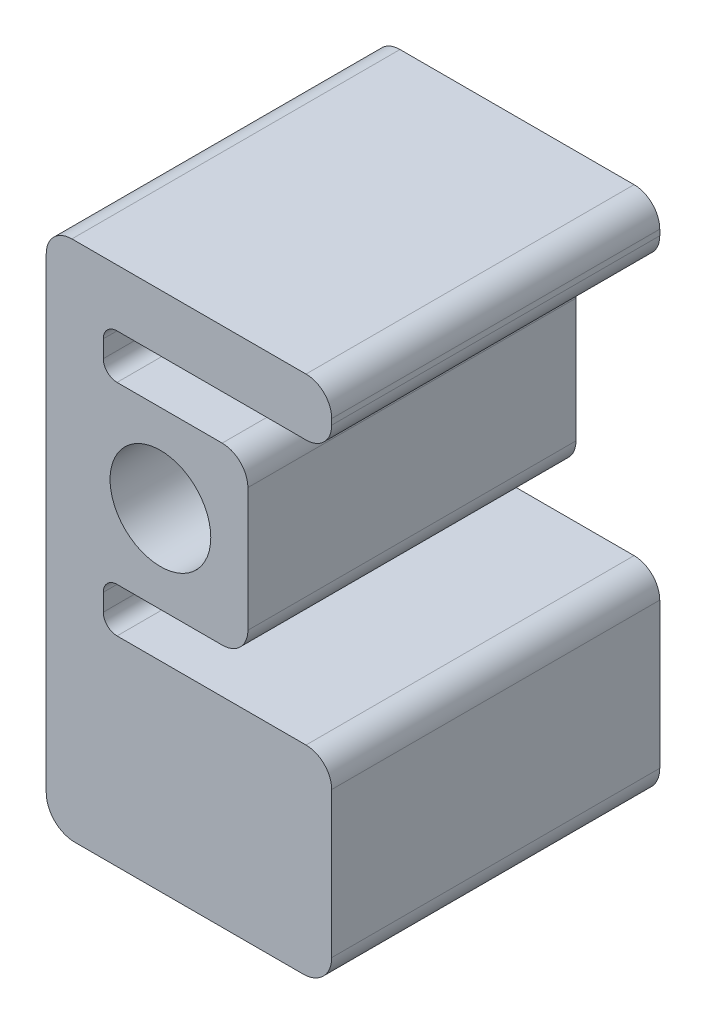
ISO-10303-21;
HEADER;
FILE_DESCRIPTION(('STEP AP214'),'2;1');
FILE_NAME('part.step','',(''),(''),'','','');
FILE_SCHEMA(('AUTOMOTIVE_DESIGN { 1 0 10303 214 1 1 1 1 }'));
ENDSEC;
DATA;
#1=APPLICATION_CONTEXT('core data for automotive mechanical design processes');
#2=APPLICATION_PROTOCOL_DEFINITION('international standard','automotive_design',2000,#1);
#3=PRODUCT_CONTEXT('',#1,'mechanical');
#4=PRODUCT('Part','Part','',(#3));
#5=PRODUCT_RELATED_PRODUCT_CATEGORY('part','',(#4));
#6=PRODUCT_DEFINITION_FORMATION('','',#4);
#7=PRODUCT_DEFINITION_CONTEXT('part definition',#1,'design');
#8=PRODUCT_DEFINITION('design','',#6,#7);
#9=PRODUCT_DEFINITION_SHAPE('','',#8);
#10=(LENGTH_UNIT() NAMED_UNIT(*) SI_UNIT(.MILLI.,.METRE.));
#11=(NAMED_UNIT(*) PLANE_ANGLE_UNIT() SI_UNIT($,.RADIAN.));
#12=(NAMED_UNIT(*) SI_UNIT($,.STERADIAN.) SOLID_ANGLE_UNIT());
#13=UNCERTAINTY_MEASURE_WITH_UNIT(LENGTH_MEASURE(1.E-05),#10,'distance_accuracy_value','');
#14=(GEOMETRIC_REPRESENTATION_CONTEXT(3) GLOBAL_UNCERTAINTY_ASSIGNED_CONTEXT((#13)) GLOBAL_UNIT_ASSIGNED_CONTEXT((#10,
#11,#12)) REPRESENTATION_CONTEXT('',''));
#15=CARTESIAN_POINT('',(0.,0.,0.));
#16=DIRECTION('',(0.,0.,1.));
#17=DIRECTION('',(1.,0.,0.));
#18=AXIS2_PLACEMENT_3D('',#15,#16,#17);
#19=CARTESIAN_POINT('',(-9.65199999999999,-22.503,72.971741788));
#20=DIRECTION('',(0.,0.,-1.));
#21=DIRECTION('',(-1.,0.,0.));
#22=AXIS2_PLACEMENT_3D('',#19,#20,#21);
#23=PLANE('',#22);
#24=DIRECTION('',(1.,0.,0.));
#25=VECTOR('',#24,1.);
#26=CARTESIAN_POINT('',(13.74,-19.455,72.971741788));
#27=LINE('',#26,#25);
#28=CARTESIAN_POINT('',(-9.65199999999999,-19.455,72.971741788));
#29=VERTEX_POINT('',#28);
#30=CARTESIAN_POINT('',(13.74,-19.455,72.971741788));
#31=VERTEX_POINT('',#30);
#32=EDGE_CURVE('E63',#29,#31,#27,.T.);
#33=ORIENTED_EDGE('',*,*,#32,.T.);
#34=CARTESIAN_POINT('',(13.74,-13.74,72.971741788));
#35=DIRECTION('',(0.,0.,1.));
#36=DIRECTION('',(-1.,0.,0.));
#37=AXIS2_PLACEMENT_3D('',#34,#35,#36);
#38=CIRCLE('',#37,5.715);
#39=CARTESIAN_POINT('',(19.455,-13.74,72.971741788));
#40=VERTEX_POINT('',#39);
#41=EDGE_CURVE('E155',#31,#40,#38,.T.);
#42=ORIENTED_EDGE('',*,*,#41,.T.);
#43=DIRECTION('',(0.,1.,0.));
#44=VECTOR('',#43,1.);
#45=CARTESIAN_POINT('',(19.455,0.,72.971741788));
#46=LINE('',#45,#44);
#47=CARTESIAN_POINT('',(19.455,13.74,72.971741788));
#48=VERTEX_POINT('',#47);
#49=EDGE_CURVE('E402',#40,#48,#46,.T.);
#50=ORIENTED_EDGE('',*,*,#49,.T.);
#51=CARTESIAN_POINT('',(13.74,13.74,72.971741788));
#52=DIRECTION('',(0.,0.,1.));
#53=DIRECTION('',(-1.,0.,0.));
#54=AXIS2_PLACEMENT_3D('',#51,#52,#53);
#55=CIRCLE('',#54,5.715);
#56=CARTESIAN_POINT('',(13.74,19.455,72.971741788));
#57=VERTEX_POINT('',#56);
#58=EDGE_CURVE('E422',#48,#57,#55,.T.);
#59=ORIENTED_EDGE('',*,*,#58,.T.);
#60=DIRECTION('',(-1.,0.,0.));
#61=VECTOR('',#60,1.);
#62=CARTESIAN_POINT('',(0.,19.455,72.971741788));
#63=LINE('',#62,#61);
#64=CARTESIAN_POINT('',(-9.65199999999999,19.455,72.971741788));
#65=VERTEX_POINT('',#64);
#66=EDGE_CURVE('E418',#57,#65,#63,.T.);
#67=ORIENTED_EDGE('',*,*,#66,.T.);
#68=CARTESIAN_POINT('',(-9.65199999999999,22.503,72.971741788));
#69=DIRECTION('',(0.,0.,-1.));
#70=DIRECTION('',(-1.,0.,0.));
#71=AXIS2_PLACEMENT_3D('',#68,#69,#70);
#72=CIRCLE('',#71,3.048);
#73=CARTESIAN_POINT('',(-12.7,22.503,72.971741788));
#74=VERTEX_POINT('',#73);
#75=EDGE_CURVE('E421',#65,#74,#72,.T.);
#76=ORIENTED_EDGE('',*,*,#75,.T.);
#77=DIRECTION('',(0.,1.,0.));
#78=VECTOR('',#77,1.);
#79=CARTESIAN_POINT('',(-12.7,22.503,72.971741788));
#80=LINE('',#79,#78);
#81=CARTESIAN_POINT('',(-12.7,26.332,72.971741788));
#82=VERTEX_POINT('',#81);
#83=EDGE_CURVE('E426',#74,#82,#80,.T.);
#84=ORIENTED_EDGE('',*,*,#83,.T.);
#85=CARTESIAN_POINT('',(-9.65199999999999,26.332,72.971741788));
#86=DIRECTION('',(0.,0.,-1.));
#87=DIRECTION('',(-1.,0.,0.));
#88=AXIS2_PLACEMENT_3D('',#85,#86,#87);
#89=CIRCLE('',#88,3.048);
#90=CARTESIAN_POINT('',(-9.65199999999999,29.38,72.971741788));
#91=VERTEX_POINT('',#90);
#92=EDGE_CURVE('E433',#82,#91,#89,.T.);
#93=ORIENTED_EDGE('',*,*,#92,.T.);
#94=DIRECTION('',(1.,0.,0.));
#95=VECTOR('',#94,1.);
#96=CARTESIAN_POINT('',(-9.65199999999999,29.38,72.971741788));
#97=LINE('',#96,#95);
#98=CARTESIAN_POINT('',(32.385,29.38,72.971741788));
#99=VERTEX_POINT('',#98);
#100=EDGE_CURVE('E436',#91,#99,#97,.T.);
#101=ORIENTED_EDGE('',*,*,#100,.T.);
#102=CARTESIAN_POINT('',(32.385,35.095,72.971741788));
#103=DIRECTION('',(0.,0.,1.));
#104=DIRECTION('',(1.,0.,0.));
#105=AXIS2_PLACEMENT_3D('',#102,#103,#104);
#106=CIRCLE('',#105,5.715);
#107=CARTESIAN_POINT('',(38.1,35.095,72.971741788));
#108=VERTEX_POINT('',#107);
#109=EDGE_CURVE('E439',#99,#108,#106,.T.);
#110=ORIENTED_EDGE('',*,*,#109,.T.);
#111=DIRECTION('',(0.,1.,0.));
#112=VECTOR('',#111,1.);
#113=CARTESIAN_POINT('',(38.1,35.095,72.971741788));
#114=LINE('',#113,#112);
#115=CARTESIAN_POINT('',(38.1,36.365,72.971741788));
#116=VERTEX_POINT('',#115);
#117=EDGE_CURVE('E442',#108,#116,#114,.T.);
#118=ORIENTED_EDGE('',*,*,#117,.T.);
#119=CARTESIAN_POINT('',(32.385,36.365,72.971741788));
#120=DIRECTION('',(0.,0.,1.));
#121=DIRECTION('',(1.,0.,0.));
#122=AXIS2_PLACEMENT_3D('',#119,#120,#121);
#123=CIRCLE('',#122,5.715);
#124=CARTESIAN_POINT('',(32.385,42.08,72.971741788));
#125=VERTEX_POINT('',#124);
#126=EDGE_CURVE('E445',#116,#125,#123,.T.);
#127=ORIENTED_EDGE('',*,*,#126,.T.);
#128=DIRECTION('',(-1.,0.,0.));
#129=VECTOR('',#128,1.);
#130=CARTESIAN_POINT('',(32.385,42.08,72.971741788));
#131=LINE('',#130,#129);
#132=CARTESIAN_POINT('',(-19.685,42.08,72.971741788));
#133=VERTEX_POINT('',#132);
#134=EDGE_CURVE('E448',#125,#133,#131,.T.);
#135=ORIENTED_EDGE('',*,*,#134,.T.);
#136=CARTESIAN_POINT('',(-19.685,36.365,72.971741788));
#137=DIRECTION('',(0.,0.,1.));
#138=DIRECTION('',(1.,0.,0.));
#139=AXIS2_PLACEMENT_3D('',#136,#137,#138);
#140=CIRCLE('',#139,5.71499999999999);
#141=CARTESIAN_POINT('',(-25.4,36.365,72.971741788));
#142=VERTEX_POINT('',#141);
#143=EDGE_CURVE('E451',#133,#142,#140,.T.);
#144=ORIENTED_EDGE('',*,*,#143,.T.);
#145=DIRECTION('',(0.,-1.,0.));
#146=VECTOR('',#145,1.);
#147=CARTESIAN_POINT('',(-25.4,-67.4799999619999,72.971741788));
#148=LINE('',#147,#146);
#149=CARTESIAN_POINT('',(-25.4,-67.479999962,72.971741788));
#150=VERTEX_POINT('',#149);
#151=EDGE_CURVE('E454',#142,#150,#148,.T.);
#152=ORIENTED_EDGE('',*,*,#151,.T.);
#153=CARTESIAN_POINT('',(-19.05,-67.479999962,72.971741788));
#154=DIRECTION('',(0.,0.,1.));
#155=DIRECTION('',(-1.,0.,0.));
#156=AXIS2_PLACEMENT_3D('',#153,#154,#155);
#157=CIRCLE('',#156,6.35);
#158=CARTESIAN_POINT('',(-19.0499999999999,-73.829999962,72.971741788));
#159=VERTEX_POINT('',#158);
#160=EDGE_CURVE('E457',#150,#159,#157,.T.);
#161=ORIENTED_EDGE('',*,*,#160,.T.);
#162=DIRECTION('',(1.,0.,0.));
#163=VECTOR('',#162,1.);
#164=CARTESIAN_POINT('',(31.75,-73.829999962,72.971741788));
#165=LINE('',#164,#163);
#166=CARTESIAN_POINT('',(31.75,-73.829999962,72.971741788));
#167=VERTEX_POINT('',#166);
#168=EDGE_CURVE('E460',#159,#167,#165,.T.);
#169=ORIENTED_EDGE('',*,*,#168,.T.);
#170=CARTESIAN_POINT('',(31.75,-67.479999962,72.971741788));
#171=DIRECTION('',(0.,0.,1.));
#172=DIRECTION('',(1.,0.,0.));
#173=AXIS2_PLACEMENT_3D('',#170,#171,#172);
#174=CIRCLE('',#173,6.35);
#175=CARTESIAN_POINT('',(38.1,-67.4799999619999,72.971741788));
#176=VERTEX_POINT('',#175);
#177=EDGE_CURVE('E463',#167,#176,#174,.T.);
#178=ORIENTED_EDGE('',*,*,#177,.T.);
#179=DIRECTION('',(0.,1.,0.));
#180=VECTOR('',#179,1.);
#181=CARTESIAN_POINT('',(38.1,-67.4799999619999,72.971741788));
#182=LINE('',#181,#180);
#183=CARTESIAN_POINT('',(38.1,-35.094999962,72.971741788));
#184=VERTEX_POINT('',#183);
#185=EDGE_CURVE('E466',#176,#184,#182,.T.);
#186=ORIENTED_EDGE('',*,*,#185,.T.);
#187=CARTESIAN_POINT('',(32.385,-35.094999962,72.971741788));
#188=DIRECTION('',(0.,0.,1.));
#189=DIRECTION('',(1.,0.,0.));
#190=AXIS2_PLACEMENT_3D('',#187,#188,#189);
#191=CIRCLE('',#190,5.71499999999999);
#192=CARTESIAN_POINT('',(32.385,-29.379999962,72.971741788));
#193=VERTEX_POINT('',#192);
#194=EDGE_CURVE('E469',#184,#193,#191,.T.);
#195=ORIENTED_EDGE('',*,*,#194,.T.);
#196=DIRECTION('',(-1.,0.,0.));
#197=VECTOR('',#196,1.);
#198=CARTESIAN_POINT('',(32.385,-29.379999962,72.971741788));
#199=LINE('',#198,#197);
#200=CARTESIAN_POINT('',(-9.65199999999999,-29.379999962,72.971741788));
#201=VERTEX_POINT('',#200);
#202=EDGE_CURVE('E223',#193,#201,#199,.T.);
#203=ORIENTED_EDGE('',*,*,#202,.T.);
#204=CARTESIAN_POINT('',(-9.65199999999999,-26.331999962,72.971741788));
#205=DIRECTION('',(0.,0.,-1.));
#206=DIRECTION('',(-1.,0.,0.));
#207=AXIS2_PLACEMENT_3D('',#204,#205,#206);
#208=CIRCLE('',#207,3.048);
#209=CARTESIAN_POINT('',(-12.7,-26.331999962,72.971741788));
#210=VERTEX_POINT('',#209);
#211=EDGE_CURVE('E217',#201,#210,#208,.T.);
#212=ORIENTED_EDGE('',*,*,#211,.T.);
#213=DIRECTION('',(0.,1.,0.));
#214=VECTOR('',#213,1.);
#215=CARTESIAN_POINT('',(-12.7,-26.331999962,72.971741788));
#216=LINE('',#215,#214);
#217=CARTESIAN_POINT('',(-12.7,-22.503,72.971741788));
#218=VERTEX_POINT('',#217);
#219=EDGE_CURVE('E221',#210,#218,#216,.T.);
#220=ORIENTED_EDGE('',*,*,#219,.T.);
#221=CARTESIAN_POINT('',(-9.65199999999999,-22.503,72.971741788));
#222=DIRECTION('',(0.,0.,-1.));
#223=DIRECTION('',(-1.,0.,0.));
#224=AXIS2_PLACEMENT_3D('',#221,#222,#223);
#225=CIRCLE('',#224,3.048);
#226=EDGE_CURVE('E240',#218,#29,#225,.T.);
#227=ORIENTED_EDGE('',*,*,#226,.T.);
#228=EDGE_LOOP('',(#33,#42,#50,#59,#67,#76,#84,#93,#101,#110,#118,#127,#135,#144,#152,#161,#169,
#178,#186,#195,#203,#212,#220,#227));
#229=FACE_BOUND('',#228,.T.);
#230=CARTESIAN_POINT('',(0.,0.,72.971741788));
#231=DIRECTION('',(0.,0.,1.));
#232=DIRECTION('',(1.,0.,0.));
#233=AXIS2_PLACEMENT_3D('',#230,#231,#232);
#234=CIRCLE('',#233,11.2);
#235=CARTESIAN_POINT('',(11.2,0.,72.971741788));
#236=VERTEX_POINT('',#235);
#237=EDGE_CURVE('E252',#236,#236,#234,.T.);
#238=ORIENTED_EDGE('',*,*,#237,.F.);
#239=EDGE_LOOP('',(#238));
#240=FACE_BOUND('',#239,.T.);
#241=ADVANCED_FACE('F45',(#229,#240),#23,.F.);
#242=CARTESIAN_POINT('',(-9.65199999999999,-22.503,0.));
#243=DIRECTION('',(0.,0.,-1.));
#244=DIRECTION('',(-1.,0.,0.));
#245=AXIS2_PLACEMENT_3D('',#242,#243,#244);
#246=PLANE('',#245);
#247=CARTESIAN_POINT('',(13.74,-13.74,0.));
#248=DIRECTION('',(0.,0.,1.));
#249=DIRECTION('',(-1.,0.,0.));
#250=AXIS2_PLACEMENT_3D('',#247,#248,#249);
#251=CIRCLE('',#250,5.715);
#252=CARTESIAN_POINT('',(13.74,-19.455,0.));
#253=VERTEX_POINT('',#252);
#254=CARTESIAN_POINT('',(19.455,-13.74,0.));
#255=VERTEX_POINT('',#254);
#256=EDGE_CURVE('E247',#253,#255,#251,.T.);
#257=ORIENTED_EDGE('',*,*,#256,.F.);
#258=DIRECTION('',(1.,0.,0.));
#259=VECTOR('',#258,1.);
#260=CARTESIAN_POINT('',(-9.65199999999999,-19.455,0.));
#261=LINE('',#260,#259);
#262=CARTESIAN_POINT('',(-9.65199999999999,-19.455,0.));
#263=VERTEX_POINT('',#262);
#264=EDGE_CURVE('E316',#263,#253,#261,.T.);
#265=ORIENTED_EDGE('',*,*,#264,.F.);
#266=CARTESIAN_POINT('',(-9.65199999999999,-22.503,0.));
#267=DIRECTION('',(0.,0.,-1.));
#268=DIRECTION('',(-1.,0.,0.));
#269=AXIS2_PLACEMENT_3D('',#266,#267,#268);
#270=CIRCLE('',#269,3.048);
#271=CARTESIAN_POINT('',(-12.7,-22.503,0.));
#272=VERTEX_POINT('',#271);
#273=EDGE_CURVE('E148',#272,#263,#270,.T.);
#274=ORIENTED_EDGE('',*,*,#273,.F.);
#275=DIRECTION('',(0.,1.,0.));
#276=VECTOR('',#275,1.);
#277=CARTESIAN_POINT('',(-12.7,-26.331999962,0.));
#278=LINE('',#277,#276);
#279=CARTESIAN_POINT('',(-12.7,-26.331999962,0.));
#280=VERTEX_POINT('',#279);
#281=EDGE_CURVE('E141',#280,#272,#278,.T.);
#282=ORIENTED_EDGE('',*,*,#281,.F.);
#283=CARTESIAN_POINT('',(-9.65199999999999,-26.331999962,0.));
#284=DIRECTION('',(0.,0.,-1.));
#285=DIRECTION('',(-1.,0.,0.));
#286=AXIS2_PLACEMENT_3D('',#283,#284,#285);
#287=CIRCLE('',#286,3.048);
#288=CARTESIAN_POINT('',(-9.65199999999999,-29.379999962,0.));
#289=VERTEX_POINT('',#288);
#290=EDGE_CURVE('E232',#289,#280,#287,.T.);
#291=ORIENTED_EDGE('',*,*,#290,.F.);
#292=DIRECTION('',(-1.,0.,0.));
#293=VECTOR('',#292,1.);
#294=CARTESIAN_POINT('',(32.385,-29.379999962,0.));
#295=LINE('',#294,#293);
#296=CARTESIAN_POINT('',(32.385,-29.379999962,0.));
#297=VERTEX_POINT('',#296);
#298=EDGE_CURVE('E307',#297,#289,#295,.T.);
#299=ORIENTED_EDGE('',*,*,#298,.F.);
#300=CARTESIAN_POINT('',(32.385,-35.094999962,0.));
#301=DIRECTION('',(0.,0.,1.));
#302=DIRECTION('',(1.,0.,0.));
#303=AXIS2_PLACEMENT_3D('',#300,#301,#302);
#304=CIRCLE('',#303,5.71499999999999);
#305=CARTESIAN_POINT('',(38.1,-35.094999962,0.));
#306=VERTEX_POINT('',#305);
#307=EDGE_CURVE('E304',#306,#297,#304,.T.);
#308=ORIENTED_EDGE('',*,*,#307,.F.);
#309=DIRECTION('',(0.,1.,0.));
#310=VECTOR('',#309,1.);
#311=CARTESIAN_POINT('',(38.1,-67.4799999619999,0.));
#312=LINE('',#311,#310);
#313=CARTESIAN_POINT('',(38.1,-67.4799999619999,0.));
#314=VERTEX_POINT('',#313);
#315=EDGE_CURVE('E301',#314,#306,#312,.T.);
#316=ORIENTED_EDGE('',*,*,#315,.F.);
#317=CARTESIAN_POINT('',(31.75,-67.479999962,0.));
#318=DIRECTION('',(0.,0.,1.));
#319=DIRECTION('',(1.,0.,0.));
#320=AXIS2_PLACEMENT_3D('',#317,#318,#319);
#321=CIRCLE('',#320,6.35);
#322=CARTESIAN_POINT('',(31.75,-73.829999962,0.));
#323=VERTEX_POINT('',#322);
#324=EDGE_CURVE('E298',#323,#314,#321,.T.);
#325=ORIENTED_EDGE('',*,*,#324,.F.);
#326=DIRECTION('',(1.,0.,0.));
#327=VECTOR('',#326,1.);
#328=CARTESIAN_POINT('',(31.75,-73.829999962,0.));
#329=LINE('',#328,#327);
#330=CARTESIAN_POINT('',(-19.0499999999999,-73.829999962,0.));
#331=VERTEX_POINT('',#330);
#332=EDGE_CURVE('E295',#331,#323,#329,.T.);
#333=ORIENTED_EDGE('',*,*,#332,.F.);
#334=CARTESIAN_POINT('',(-19.05,-67.479999962,0.));
#335=DIRECTION('',(0.,0.,1.));
#336=DIRECTION('',(-1.,0.,0.));
#337=AXIS2_PLACEMENT_3D('',#334,#335,#336);
#338=CIRCLE('',#337,6.35);
#339=CARTESIAN_POINT('',(-25.4,-67.479999962,0.));
#340=VERTEX_POINT('',#339);
#341=EDGE_CURVE('E292',#340,#331,#338,.T.);
#342=ORIENTED_EDGE('',*,*,#341,.F.);
#343=DIRECTION('',(0.,-1.,0.));
#344=VECTOR('',#343,1.);
#345=CARTESIAN_POINT('',(-25.4,-67.4799999619999,0.));
#346=LINE('',#345,#344);
#347=CARTESIAN_POINT('',(-25.4,36.365,0.));
#348=VERTEX_POINT('',#347);
#349=EDGE_CURVE('E289',#348,#340,#346,.T.);
#350=ORIENTED_EDGE('',*,*,#349,.F.);
#351=CARTESIAN_POINT('',(-19.685,36.365,0.));
#352=DIRECTION('',(0.,0.,1.));
#353=DIRECTION('',(1.,0.,0.));
#354=AXIS2_PLACEMENT_3D('',#351,#352,#353);
#355=CIRCLE('',#354,5.71499999999999);
#356=CARTESIAN_POINT('',(-19.685,42.08,0.));
#357=VERTEX_POINT('',#356);
#358=EDGE_CURVE('E286',#357,#348,#355,.T.);
#359=ORIENTED_EDGE('',*,*,#358,.F.);
#360=DIRECTION('',(-1.,0.,0.));
#361=VECTOR('',#360,1.);
#362=CARTESIAN_POINT('',(32.385,42.08,0.));
#363=LINE('',#362,#361);
#364=CARTESIAN_POINT('',(32.385,42.08,0.));
#365=VERTEX_POINT('',#364);
#366=EDGE_CURVE('E283',#365,#357,#363,.T.);
#367=ORIENTED_EDGE('',*,*,#366,.F.);
#368=CARTESIAN_POINT('',(32.385,36.365,0.));
#369=DIRECTION('',(0.,0.,1.));
#370=DIRECTION('',(1.,0.,0.));
#371=AXIS2_PLACEMENT_3D('',#368,#369,#370);
#372=CIRCLE('',#371,5.715);
#373=CARTESIAN_POINT('',(38.1,36.365,0.));
#374=VERTEX_POINT('',#373);
#375=EDGE_CURVE('E280',#374,#365,#372,.T.);
#376=ORIENTED_EDGE('',*,*,#375,.F.);
#377=DIRECTION('',(0.,1.,0.));
#378=VECTOR('',#377,1.);
#379=CARTESIAN_POINT('',(38.1,35.095,0.));
#380=LINE('',#379,#378);
#381=CARTESIAN_POINT('',(38.1,35.095,0.));
#382=VERTEX_POINT('',#381);
#383=EDGE_CURVE('E277',#382,#374,#380,.T.);
#384=ORIENTED_EDGE('',*,*,#383,.F.);
#385=CARTESIAN_POINT('',(32.385,35.095,0.));
#386=DIRECTION('',(0.,0.,1.));
#387=DIRECTION('',(1.,0.,0.));
#388=AXIS2_PLACEMENT_3D('',#385,#386,#387);
#389=CIRCLE('',#388,5.715);
#390=CARTESIAN_POINT('',(32.385,29.38,0.));
#391=VERTEX_POINT('',#390);
#392=EDGE_CURVE('E274',#391,#382,#389,.T.);
#393=ORIENTED_EDGE('',*,*,#392,.F.);
#394=DIRECTION('',(1.,0.,0.));
#395=VECTOR('',#394,1.);
#396=CARTESIAN_POINT('',(-9.65199999999999,29.38,0.));
#397=LINE('',#396,#395);
#398=CARTESIAN_POINT('',(-9.65199999999999,29.38,0.));
#399=VERTEX_POINT('',#398);
#400=EDGE_CURVE('E271',#399,#391,#397,.T.);
#401=ORIENTED_EDGE('',*,*,#400,.F.);
#402=CARTESIAN_POINT('',(-9.65199999999999,26.332,0.));
#403=DIRECTION('',(0.,0.,-1.));
#404=DIRECTION('',(-1.,0.,0.));
#405=AXIS2_PLACEMENT_3D('',#402,#403,#404);
#406=CIRCLE('',#405,3.048);
#407=CARTESIAN_POINT('',(-12.7,26.332,0.));
#408=VERTEX_POINT('',#407);
#409=EDGE_CURVE('E268',#408,#399,#406,.T.);
#410=ORIENTED_EDGE('',*,*,#409,.F.);
#411=DIRECTION('',(0.,1.,0.));
#412=VECTOR('',#411,1.);
#413=CARTESIAN_POINT('',(-12.7,22.503,0.));
#414=LINE('',#413,#412);
#415=CARTESIAN_POINT('',(-12.7,22.503,0.));
#416=VERTEX_POINT('',#415);
#417=EDGE_CURVE('E265',#416,#408,#414,.T.);
#418=ORIENTED_EDGE('',*,*,#417,.F.);
#419=CARTESIAN_POINT('',(-9.65199999999999,22.503,0.));
#420=DIRECTION('',(0.,0.,-1.));
#421=DIRECTION('',(-1.,0.,0.));
#422=AXIS2_PLACEMENT_3D('',#419,#420,#421);
#423=CIRCLE('',#422,3.048);
#424=CARTESIAN_POINT('',(-9.65199999999999,19.455,0.));
#425=VERTEX_POINT('',#424);
#426=EDGE_CURVE('E262',#425,#416,#423,.T.);
#427=ORIENTED_EDGE('',*,*,#426,.F.);
#428=DIRECTION('',(-1.,0.,0.));
#429=VECTOR('',#428,1.);
#430=CARTESIAN_POINT('',(-9.65199999999999,19.455,0.));
#431=LINE('',#430,#429);
#432=CARTESIAN_POINT('',(13.74,19.455,0.));
#433=VERTEX_POINT('',#432);
#434=EDGE_CURVE('E259',#433,#425,#431,.T.);
#435=ORIENTED_EDGE('',*,*,#434,.F.);
#436=CARTESIAN_POINT('',(13.74,13.74,0.));
#437=DIRECTION('',(0.,0.,1.));
#438=DIRECTION('',(-1.,0.,0.));
#439=AXIS2_PLACEMENT_3D('',#436,#437,#438);
#440=CIRCLE('',#439,5.715);
#441=CARTESIAN_POINT('',(19.455,13.74,0.));
#442=VERTEX_POINT('',#441);
#443=EDGE_CURVE('E255',#442,#433,#440,.T.);
#444=ORIENTED_EDGE('',*,*,#443,.F.);
#445=DIRECTION('',(0.,1.,0.));
#446=VECTOR('',#445,1.);
#447=CARTESIAN_POINT('',(19.455,13.74,0.));
#448=LINE('',#447,#446);
#449=EDGE_CURVE('E251',#255,#442,#448,.T.);
#450=ORIENTED_EDGE('',*,*,#449,.F.);
#451=EDGE_LOOP('',(#257,#265,#274,#282,#291,#299,#308,#316,#325,#333,#342,#350,#359,#367,#376,
#384,#393,#401,#410,#418,#427,#435,#444,#450));
#452=FACE_BOUND('',#451,.T.);
#453=CARTESIAN_POINT('',(0.,0.,0.));
#454=DIRECTION('',(0.,0.,1.));
#455=DIRECTION('',(1.,0.,0.));
#456=AXIS2_PLACEMENT_3D('',#453,#454,#455);
#457=CIRCLE('',#456,11.2);
#458=CARTESIAN_POINT('',(11.2,0.,0.));
#459=VERTEX_POINT('',#458);
#460=EDGE_CURVE('E780',#459,#459,#457,.T.);
#461=ORIENTED_EDGE('',*,*,#460,.T.);
#462=EDGE_LOOP('',(#461));
#463=FACE_BOUND('',#462,.T.);
#464=ADVANCED_FACE('F406',(#452,#463),#246,.T.);
#465=CARTESIAN_POINT('',(13.74,-13.74,72.971741788));
#466=DIRECTION('',(0.,0.,-1.));
#467=DIRECTION('',(-1.,0.,0.));
#468=AXIS2_PLACEMENT_3D('',#465,#466,#467);
#469=CYLINDRICAL_SURFACE('',#468,5.715);
#470=ORIENTED_EDGE('',*,*,#256,.T.);
#471=DIRECTION('',(0.,0.,-1.));
#472=VECTOR('',#471,1.);
#473=CARTESIAN_POINT('',(19.455,-13.74,72.971741788));
#474=LINE('',#473,#472);
#475=EDGE_CURVE('E55',#40,#255,#474,.T.);
#476=ORIENTED_EDGE('',*,*,#475,.F.);
#477=ORIENTED_EDGE('',*,*,#41,.F.);
#478=DIRECTION('',(0.,0.,-1.));
#479=VECTOR('',#478,1.);
#480=CARTESIAN_POINT('',(13.74,-19.455,72.971741788));
#481=LINE('',#480,#479);
#482=EDGE_CURVE('E11',#31,#253,#481,.T.);
#483=ORIENTED_EDGE('',*,*,#482,.T.);
#484=EDGE_LOOP('',(#470,#476,#477,#483));
#485=FACE_BOUND('',#484,.T.);
#486=ADVANCED_FACE('F47',(#485),#469,.T.);
#487=CARTESIAN_POINT('',(19.455,13.74,72.971741788));
#488=DIRECTION('',(-1.,0.,0.));
#489=DIRECTION('',(0.,0.,1.));
#490=AXIS2_PLACEMENT_3D('',#487,#488,#489);
#491=PLANE('',#490);
#492=ORIENTED_EDGE('',*,*,#449,.T.);
#493=DIRECTION('',(0.,0.,-1.));
#494=VECTOR('',#493,1.);
#495=CARTESIAN_POINT('',(19.455,13.74,72.971741788));
#496=LINE('',#495,#494);
#497=EDGE_CURVE('E393',#48,#442,#496,.T.);
#498=ORIENTED_EDGE('',*,*,#497,.F.);
#499=ORIENTED_EDGE('',*,*,#49,.F.);
#500=ORIENTED_EDGE('',*,*,#475,.T.);
#501=EDGE_LOOP('',(#492,#498,#499,#500));
#502=FACE_BOUND('',#501,.T.);
#503=ADVANCED_FACE('F400',(#502),#491,.F.);
#504=CARTESIAN_POINT('',(13.74,13.74,72.971741788));
#505=DIRECTION('',(0.,0.,-1.));
#506=DIRECTION('',(-1.,0.,0.));
#507=AXIS2_PLACEMENT_3D('',#504,#505,#506);
#508=CYLINDRICAL_SURFACE('',#507,5.715);
#509=ORIENTED_EDGE('',*,*,#443,.T.);
#510=DIRECTION('',(0.,0.,-1.));
#511=VECTOR('',#510,1.);
#512=CARTESIAN_POINT('',(13.74,19.455,72.971741788));
#513=LINE('',#512,#511);
#514=EDGE_CURVE('E389',#57,#433,#513,.T.);
#515=ORIENTED_EDGE('',*,*,#514,.F.);
#516=ORIENTED_EDGE('',*,*,#58,.F.);
#517=ORIENTED_EDGE('',*,*,#497,.T.);
#518=EDGE_LOOP('',(#509,#515,#516,#517));
#519=FACE_BOUND('',#518,.T.);
#520=ADVANCED_FACE('F412',(#519),#508,.T.);
#521=CARTESIAN_POINT('',(-9.65199999999999,19.455,72.971741788));
#522=DIRECTION('',(0.,-1.,0.));
#523=DIRECTION('',(1.,0.,0.));
#524=AXIS2_PLACEMENT_3D('',#521,#522,#523);
#525=PLANE('',#524);
#526=ORIENTED_EDGE('',*,*,#434,.T.);
#527=DIRECTION('',(0.,0.,-1.));
#528=VECTOR('',#527,1.);
#529=CARTESIAN_POINT('',(-9.65199999999999,19.455,72.971741788));
#530=LINE('',#529,#528);
#531=EDGE_CURVE('E385',#65,#425,#530,.T.);
#532=ORIENTED_EDGE('',*,*,#531,.F.);
#533=ORIENTED_EDGE('',*,*,#66,.F.);
#534=ORIENTED_EDGE('',*,*,#514,.T.);
#535=EDGE_LOOP('',(#526,#532,#533,#534));
#536=FACE_BOUND('',#535,.T.);
#537=ADVANCED_FACE('F416',(#536),#525,.F.);
#538=CARTESIAN_POINT('',(-9.65199999999999,22.503,72.971741788));
#539=DIRECTION('',(0.,0.,-1.));
#540=DIRECTION('',(-1.,0.,0.));
#541=AXIS2_PLACEMENT_3D('',#538,#539,#540);
#542=CYLINDRICAL_SURFACE('',#541,3.048);
#543=ORIENTED_EDGE('',*,*,#426,.T.);
#544=DIRECTION('',(0.,0.,-1.));
#545=VECTOR('',#544,1.);
#546=CARTESIAN_POINT('',(-12.7,22.503,72.971741788));
#547=LINE('',#546,#545);
#548=EDGE_CURVE('E381',#74,#416,#547,.T.);
#549=ORIENTED_EDGE('',*,*,#548,.F.);
#550=ORIENTED_EDGE('',*,*,#75,.F.);
#551=ORIENTED_EDGE('',*,*,#531,.T.);
#552=EDGE_LOOP('',(#543,#549,#550,#551));
#553=FACE_BOUND('',#552,.T.);
#554=ADVANCED_FACE('F547',(#553),#542,.F.);
#555=CARTESIAN_POINT('',(-12.7,22.503,72.971741788));
#556=DIRECTION('',(-1.,0.,0.));
#557=DIRECTION('',(0.,0.,1.));
#558=AXIS2_PLACEMENT_3D('',#555,#556,#557);
#559=PLANE('',#558);
#560=ORIENTED_EDGE('',*,*,#417,.T.);
#561=DIRECTION('',(0.,0.,-1.));
#562=VECTOR('',#561,1.);
#563=CARTESIAN_POINT('',(-12.7,26.332,72.971741788));
#564=LINE('',#563,#562);
#565=EDGE_CURVE('E377',#82,#408,#564,.T.);
#566=ORIENTED_EDGE('',*,*,#565,.F.);
#567=ORIENTED_EDGE('',*,*,#83,.F.);
#568=ORIENTED_EDGE('',*,*,#548,.T.);
#569=EDGE_LOOP('',(#560,#566,#567,#568));
#570=FACE_BOUND('',#569,.T.);
#571=ADVANCED_FACE('F543',(#570),#559,.F.);
#572=CARTESIAN_POINT('',(-9.65199999999999,26.332,72.971741788));
#573=DIRECTION('',(0.,0.,-1.));
#574=DIRECTION('',(-1.,0.,0.));
#575=AXIS2_PLACEMENT_3D('',#572,#573,#574);
#576=CYLINDRICAL_SURFACE('',#575,3.048);
#577=ORIENTED_EDGE('',*,*,#409,.T.);
#578=DIRECTION('',(0.,0.,-1.));
#579=VECTOR('',#578,1.);
#580=CARTESIAN_POINT('',(-9.65199999999999,29.38,72.971741788));
#581=LINE('',#580,#579);
#582=EDGE_CURVE('E373',#91,#399,#581,.T.);
#583=ORIENTED_EDGE('',*,*,#582,.F.);
#584=ORIENTED_EDGE('',*,*,#92,.F.);
#585=ORIENTED_EDGE('',*,*,#565,.T.);
#586=EDGE_LOOP('',(#577,#583,#584,#585));
#587=FACE_BOUND('',#586,.T.);
#588=ADVANCED_FACE('F539',(#587),#576,.F.);
#589=CARTESIAN_POINT('',(-9.65199999999999,29.38,72.971741788));
#590=DIRECTION('',(0.,1.,0.));
#591=DIRECTION('',(0.,0.,1.));
#592=AXIS2_PLACEMENT_3D('',#589,#590,#591);
#593=PLANE('',#592);
#594=ORIENTED_EDGE('',*,*,#400,.T.);
#595=DIRECTION('',(0.,0.,-1.));
#596=VECTOR('',#595,1.);
#597=CARTESIAN_POINT('',(32.385,29.38,72.971741788));
#598=LINE('',#597,#596);
#599=EDGE_CURVE('E369',#99,#391,#598,.T.);
#600=ORIENTED_EDGE('',*,*,#599,.F.);
#601=ORIENTED_EDGE('',*,*,#100,.F.);
#602=ORIENTED_EDGE('',*,*,#582,.T.);
#603=EDGE_LOOP('',(#594,#600,#601,#602));
#604=FACE_BOUND('',#603,.T.);
#605=ADVANCED_FACE('F535',(#604),#593,.F.);
#606=CARTESIAN_POINT('',(32.385,35.095,72.971741788));
#607=DIRECTION('',(0.,0.,-1.));
#608=DIRECTION('',(-1.,0.,0.));
#609=AXIS2_PLACEMENT_3D('',#606,#607,#608);
#610=CYLINDRICAL_SURFACE('',#609,5.715);
#611=ORIENTED_EDGE('',*,*,#392,.T.);
#612=DIRECTION('',(0.,0.,-1.));
#613=VECTOR('',#612,1.);
#614=CARTESIAN_POINT('',(38.1,35.095,72.971741788));
#615=LINE('',#614,#613);
#616=EDGE_CURVE('E365',#108,#382,#615,.T.);
#617=ORIENTED_EDGE('',*,*,#616,.F.);
#618=ORIENTED_EDGE('',*,*,#109,.F.);
#619=ORIENTED_EDGE('',*,*,#599,.T.);
#620=EDGE_LOOP('',(#611,#617,#618,#619));
#621=FACE_BOUND('',#620,.T.);
#622=ADVANCED_FACE('F530',(#621),#610,.T.);
#623=CARTESIAN_POINT('',(38.1,35.095,72.971741788));
#624=DIRECTION('',(-1.,0.,0.));
#625=DIRECTION('',(0.,-1.,0.));
#626=AXIS2_PLACEMENT_3D('',#623,#624,#625);
#627=PLANE('',#626);
#628=ORIENTED_EDGE('',*,*,#383,.T.);
#629=DIRECTION('',(0.,0.,-1.));
#630=VECTOR('',#629,1.);
#631=CARTESIAN_POINT('',(38.1,36.365,72.971741788));
#632=LINE('',#631,#630);
#633=EDGE_CURVE('E361',#116,#374,#632,.T.);
#634=ORIENTED_EDGE('',*,*,#633,.F.);
#635=ORIENTED_EDGE('',*,*,#117,.F.);
#636=ORIENTED_EDGE('',*,*,#616,.T.);
#637=EDGE_LOOP('',(#628,#634,#635,#636));
#638=FACE_BOUND('',#637,.T.);
#639=ADVANCED_FACE('F524',(#638),#627,.F.);
#640=CARTESIAN_POINT('',(32.385,36.365,72.971741788));
#641=DIRECTION('',(0.,0.,-1.));
#642=DIRECTION('',(-1.,0.,0.));
#643=AXIS2_PLACEMENT_3D('',#640,#641,#642);
#644=CYLINDRICAL_SURFACE('',#643,5.715);
#645=ORIENTED_EDGE('',*,*,#375,.T.);
#646=DIRECTION('',(0.,0.,-1.));
#647=VECTOR('',#646,1.);
#648=CARTESIAN_POINT('',(32.385,42.08,72.971741788));
#649=LINE('',#648,#647);
#650=EDGE_CURVE('E357',#125,#365,#649,.T.);
#651=ORIENTED_EDGE('',*,*,#650,.F.);
#652=ORIENTED_EDGE('',*,*,#126,.F.);
#653=ORIENTED_EDGE('',*,*,#633,.T.);
#654=EDGE_LOOP('',(#645,#651,#652,#653));
#655=FACE_BOUND('',#654,.T.);
#656=ADVANCED_FACE('F520',(#655),#644,.T.);
#657=CARTESIAN_POINT('',(32.385,42.08,72.971741788));
#658=DIRECTION('',(0.,-1.,0.));
#659=DIRECTION('',(1.,0.,0.));
#660=AXIS2_PLACEMENT_3D('',#657,#658,#659);
#661=PLANE('',#660);
#662=ORIENTED_EDGE('',*,*,#366,.T.);
#663=DIRECTION('',(0.,0.,-1.));
#664=VECTOR('',#663,1.);
#665=CARTESIAN_POINT('',(-19.685,42.08,72.971741788));
#666=LINE('',#665,#664);
#667=EDGE_CURVE('E353',#133,#357,#666,.T.);
#668=ORIENTED_EDGE('',*,*,#667,.F.);
#669=ORIENTED_EDGE('',*,*,#134,.F.);
#670=ORIENTED_EDGE('',*,*,#650,.T.);
#671=EDGE_LOOP('',(#662,#668,#669,#670));
#672=FACE_BOUND('',#671,.T.);
#673=ADVANCED_FACE('F515',(#672),#661,.F.);
#674=CARTESIAN_POINT('',(-19.685,36.365,72.971741788));
#675=DIRECTION('',(0.,0.,-1.));
#676=DIRECTION('',(-1.,0.,0.));
#677=AXIS2_PLACEMENT_3D('',#674,#675,#676);
#678=CYLINDRICAL_SURFACE('',#677,5.71499999999999);
#679=ORIENTED_EDGE('',*,*,#358,.T.);
#680=DIRECTION('',(0.,0.,-1.));
#681=VECTOR('',#680,1.);
#682=CARTESIAN_POINT('',(-25.4,36.365,72.971741788));
#683=LINE('',#682,#681);
#684=EDGE_CURVE('E349',#142,#348,#683,.T.);
#685=ORIENTED_EDGE('',*,*,#684,.F.);
#686=ORIENTED_EDGE('',*,*,#143,.F.);
#687=ORIENTED_EDGE('',*,*,#667,.T.);
#688=EDGE_LOOP('',(#679,#685,#686,#687));
#689=FACE_BOUND('',#688,.T.);
#690=ADVANCED_FACE('F509',(#689),#678,.T.);
#691=CARTESIAN_POINT('',(-25.4,-67.4799999619999,72.971741788));
#692=DIRECTION('',(1.,0.,0.));
#693=DIRECTION('',(0.,1.,0.));
#694=AXIS2_PLACEMENT_3D('',#691,#692,#693);
#695=PLANE('',#694);
#696=ORIENTED_EDGE('',*,*,#349,.T.);
#697=DIRECTION('',(0.,0.,-1.));
#698=VECTOR('',#697,1.);
#699=CARTESIAN_POINT('',(-25.4,-67.479999962,72.971741788));
#700=LINE('',#699,#698);
#701=EDGE_CURVE('E345',#150,#340,#700,.T.);
#702=ORIENTED_EDGE('',*,*,#701,.F.);
#703=ORIENTED_EDGE('',*,*,#151,.F.);
#704=ORIENTED_EDGE('',*,*,#684,.T.);
#705=EDGE_LOOP('',(#696,#702,#703,#704));
#706=FACE_BOUND('',#705,.T.);
#707=ADVANCED_FACE('F505',(#706),#695,.F.);
#708=CARTESIAN_POINT('',(-19.05,-67.479999962,72.971741788));
#709=DIRECTION('',(0.,0.,-1.));
#710=DIRECTION('',(-1.,0.,0.));
#711=AXIS2_PLACEMENT_3D('',#708,#709,#710);
#712=CYLINDRICAL_SURFACE('',#711,6.35);
#713=ORIENTED_EDGE('',*,*,#341,.T.);
#714=DIRECTION('',(0.,0.,-1.));
#715=VECTOR('',#714,1.);
#716=CARTESIAN_POINT('',(-19.0499999999999,-73.829999962,72.971741788));
#717=LINE('',#716,#715);
#718=EDGE_CURVE('E341',#159,#331,#717,.T.);
#719=ORIENTED_EDGE('',*,*,#718,.F.);
#720=ORIENTED_EDGE('',*,*,#160,.F.);
#721=ORIENTED_EDGE('',*,*,#701,.T.);
#722=EDGE_LOOP('',(#713,#719,#720,#721));
#723=FACE_BOUND('',#722,.T.);
#724=ADVANCED_FACE('F500',(#723),#712,.T.);
#725=CARTESIAN_POINT('',(31.75,-73.829999962,72.971741788));
#726=DIRECTION('',(0.,1.,0.));
#727=DIRECTION('',(0.,0.,1.));
#728=AXIS2_PLACEMENT_3D('',#725,#726,#727);
#729=PLANE('',#728);
#730=ORIENTED_EDGE('',*,*,#332,.T.);
#731=DIRECTION('',(0.,0.,-1.));
#732=VECTOR('',#731,1.);
#733=CARTESIAN_POINT('',(31.75,-73.829999962,72.971741788));
#734=LINE('',#733,#732);
#735=EDGE_CURVE('E337',#167,#323,#734,.T.);
#736=ORIENTED_EDGE('',*,*,#735,.F.);
#737=ORIENTED_EDGE('',*,*,#168,.F.);
#738=ORIENTED_EDGE('',*,*,#718,.T.);
#739=EDGE_LOOP('',(#730,#736,#737,#738));
#740=FACE_BOUND('',#739,.T.);
#741=ADVANCED_FACE('F494',(#740),#729,.F.);
#742=CARTESIAN_POINT('',(31.75,-67.479999962,72.971741788));
#743=DIRECTION('',(0.,0.,-1.));
#744=DIRECTION('',(-1.,0.,0.));
#745=AXIS2_PLACEMENT_3D('',#742,#743,#744);
#746=CYLINDRICAL_SURFACE('',#745,6.35);
#747=ORIENTED_EDGE('',*,*,#324,.T.);
#748=DIRECTION('',(0.,0.,-1.));
#749=VECTOR('',#748,1.);
#750=CARTESIAN_POINT('',(38.1,-67.4799999619999,72.971741788));
#751=LINE('',#750,#749);
#752=EDGE_CURVE('E333',#176,#314,#751,.T.);
#753=ORIENTED_EDGE('',*,*,#752,.F.);
#754=ORIENTED_EDGE('',*,*,#177,.F.);
#755=ORIENTED_EDGE('',*,*,#735,.T.);
#756=EDGE_LOOP('',(#747,#753,#754,#755));
#757=FACE_BOUND('',#756,.T.);
#758=ADVANCED_FACE('F490',(#757),#746,.T.);
#759=CARTESIAN_POINT('',(38.1,-67.4799999619999,72.971741788));
#760=DIRECTION('',(-1.,0.,0.));
#761=DIRECTION('',(0.,-1.,0.));
#762=AXIS2_PLACEMENT_3D('',#759,#760,#761);
#763=PLANE('',#762);
#764=ORIENTED_EDGE('',*,*,#315,.T.);
#765=DIRECTION('',(0.,0.,-1.));
#766=VECTOR('',#765,1.);
#767=CARTESIAN_POINT('',(38.1,-35.094999962,72.971741788));
#768=LINE('',#767,#766);
#769=EDGE_CURVE('E329',#184,#306,#768,.T.);
#770=ORIENTED_EDGE('',*,*,#769,.F.);
#771=ORIENTED_EDGE('',*,*,#185,.F.);
#772=ORIENTED_EDGE('',*,*,#752,.T.);
#773=EDGE_LOOP('',(#764,#770,#771,#772));
#774=FACE_BOUND('',#773,.T.);
#775=ADVANCED_FACE('F486',(#774),#763,.F.);
#776=CARTESIAN_POINT('',(32.385,-35.094999962,72.971741788));
#777=DIRECTION('',(0.,0.,-1.));
#778=DIRECTION('',(-1.,0.,0.));
#779=AXIS2_PLACEMENT_3D('',#776,#777,#778);
#780=CYLINDRICAL_SURFACE('',#779,5.71499999999999);
#781=ORIENTED_EDGE('',*,*,#307,.T.);
#782=DIRECTION('',(0.,0.,-1.));
#783=VECTOR('',#782,1.);
#784=CARTESIAN_POINT('',(32.385,-29.379999962,72.971741788));
#785=LINE('',#784,#783);
#786=EDGE_CURVE('E325',#193,#297,#785,.T.);
#787=ORIENTED_EDGE('',*,*,#786,.F.);
#788=ORIENTED_EDGE('',*,*,#194,.F.);
#789=ORIENTED_EDGE('',*,*,#769,.T.);
#790=EDGE_LOOP('',(#781,#787,#788,#789));
#791=FACE_BOUND('',#790,.T.);
#792=ADVANCED_FACE('F477',(#791),#780,.T.);
#793=CARTESIAN_POINT('',(32.385,-29.379999962,72.971741788));
#794=DIRECTION('',(0.,-1.,0.));
#795=DIRECTION('',(1.,0.,0.));
#796=AXIS2_PLACEMENT_3D('',#793,#794,#795);
#797=PLANE('',#796);
#798=ORIENTED_EDGE('',*,*,#298,.T.);
#799=DIRECTION('',(0.,0.,-1.));
#800=VECTOR('',#799,1.);
#801=CARTESIAN_POINT('',(-9.65199999999999,-29.379999962,72.971741788));
#802=LINE('',#801,#800);
#803=EDGE_CURVE('E234',#201,#289,#802,.T.);
#804=ORIENTED_EDGE('',*,*,#803,.F.);
#805=ORIENTED_EDGE('',*,*,#202,.F.);
#806=ORIENTED_EDGE('',*,*,#786,.T.);
#807=EDGE_LOOP('',(#798,#804,#805,#806));
#808=FACE_BOUND('',#807,.T.);
#809=ADVANCED_FACE('F481',(#808),#797,.F.);
#810=CARTESIAN_POINT('',(-9.65199999999999,-26.331999962,72.971741788));
#811=DIRECTION('',(0.,0.,-1.));
#812=DIRECTION('',(-1.,0.,0.));
#813=AXIS2_PLACEMENT_3D('',#810,#811,#812);
#814=CYLINDRICAL_SURFACE('',#813,3.048);
#815=ORIENTED_EDGE('',*,*,#290,.T.);
#816=DIRECTION('',(0.,0.,-1.));
#817=VECTOR('',#816,1.);
#818=CARTESIAN_POINT('',(-12.7,-26.331999962,72.971741788));
#819=LINE('',#818,#817);
#820=EDGE_CURVE('E229',#210,#280,#819,.T.);
#821=ORIENTED_EDGE('',*,*,#820,.F.);
#822=ORIENTED_EDGE('',*,*,#211,.F.);
#823=ORIENTED_EDGE('',*,*,#803,.T.);
#824=EDGE_LOOP('',(#815,#821,#822,#823));
#825=FACE_BOUND('',#824,.T.);
#826=ADVANCED_FACE('F230',(#825),#814,.F.);
#827=CARTESIAN_POINT('',(-12.7,-26.331999962,72.971741788));
#828=DIRECTION('',(-1.,0.,0.));
#829=DIRECTION('',(0.,0.,1.));
#830=AXIS2_PLACEMENT_3D('',#827,#828,#829);
#831=PLANE('',#830);
#832=ORIENTED_EDGE('',*,*,#281,.T.);
#833=DIRECTION('',(0.,0.,-1.));
#834=VECTOR('',#833,1.);
#835=CARTESIAN_POINT('',(-12.7,-22.503,72.971741788));
#836=LINE('',#835,#834);
#837=EDGE_CURVE('E235',#218,#272,#836,.T.);
#838=ORIENTED_EDGE('',*,*,#837,.F.);
#839=ORIENTED_EDGE('',*,*,#219,.F.);
#840=ORIENTED_EDGE('',*,*,#820,.T.);
#841=EDGE_LOOP('',(#832,#838,#839,#840));
#842=FACE_BOUND('',#841,.T.);
#843=ADVANCED_FACE('F237',(#842),#831,.F.);
#844=CARTESIAN_POINT('',(-9.65199999999999,-22.503,72.971741788));
#845=DIRECTION('',(0.,0.,-1.));
#846=DIRECTION('',(-1.,0.,0.));
#847=AXIS2_PLACEMENT_3D('',#844,#845,#846);
#848=CYLINDRICAL_SURFACE('',#847,3.048);
#849=ORIENTED_EDGE('',*,*,#273,.T.);
#850=DIRECTION('',(0.,0.,-1.));
#851=VECTOR('',#850,1.);
#852=CARTESIAN_POINT('',(-9.65199999999999,-19.455,72.971741788));
#853=LINE('',#852,#851);
#854=EDGE_CURVE('E243',#29,#263,#853,.T.);
#855=ORIENTED_EDGE('',*,*,#854,.F.);
#856=ORIENTED_EDGE('',*,*,#226,.F.);
#857=ORIENTED_EDGE('',*,*,#837,.T.);
#858=EDGE_LOOP('',(#849,#855,#856,#857));
#859=FACE_BOUND('',#858,.T.);
#860=ADVANCED_FACE('F568',(#859),#848,.F.);
#861=CARTESIAN_POINT('',(-9.65199999999999,-19.455,72.971741788));
#862=DIRECTION('',(0.,1.,0.));
#863=DIRECTION('',(-1.,0.,0.));
#864=AXIS2_PLACEMENT_3D('',#861,#862,#863);
#865=PLANE('',#864);
#866=ORIENTED_EDGE('',*,*,#264,.T.);
#867=ORIENTED_EDGE('',*,*,#482,.F.);
#868=ORIENTED_EDGE('',*,*,#32,.F.);
#869=ORIENTED_EDGE('',*,*,#854,.T.);
#870=EDGE_LOOP('',(#866,#867,#868,#869));
#871=FACE_BOUND('',#870,.T.);
#872=ADVANCED_FACE('F565',(#871),#865,.F.);
#873=CARTESIAN_POINT('',(0.,0.,72.971741788));
#874=DIRECTION('',(0.,0.,-1.));
#875=DIRECTION('',(-1.,0.,0.));
#876=AXIS2_PLACEMENT_3D('',#873,#874,#875);
#877=CYLINDRICAL_SURFACE('',#876,11.2);
#878=ORIENTED_EDGE('',*,*,#237,.T.);
#879=EDGE_LOOP('',(#878));
#880=FACE_BOUND('',#879,.T.);
#881=ORIENTED_EDGE('',*,*,#460,.F.);
#882=EDGE_LOOP('',(#881));
#883=FACE_BOUND('',#882,.T.);
#884=ADVANCED_FACE('F563',(#880,#883),#877,.F.);
#885=CLOSED_SHELL('',(#241,#464,#486,#503,#520,#537,#554,#571,#588,#605,#622,#639,#656,#673,
#690,#707,#724,#741,#758,#775,#792,#809,#826,#843,#860,#872,#884));
#886=MANIFOLD_SOLID_BREP('B2',#885);
#887=ADVANCED_BREP_SHAPE_REPRESENTATION('',(#18,#886),#14);
#888=SHAPE_DEFINITION_REPRESENTATION(#9,#887);
ENDSEC;
END-ISO-10303-21;
